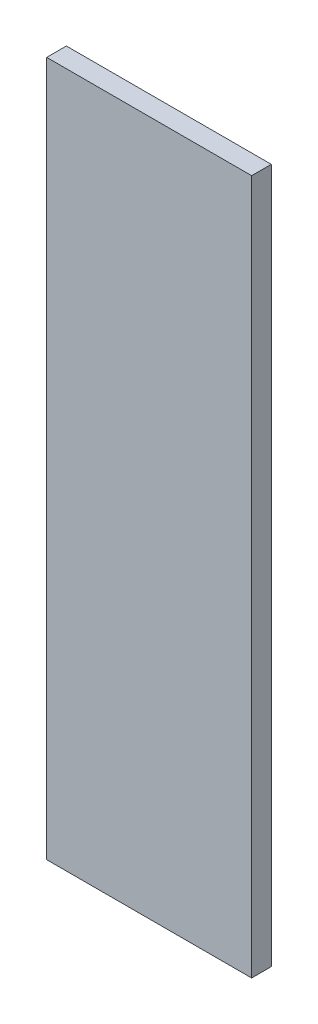
ISO-10303-21;
HEADER;
FILE_DESCRIPTION(('STEP AP214'),'2;1');
FILE_NAME('part.step','',(''),(''),'','','');
FILE_SCHEMA(('AUTOMOTIVE_DESIGN { 1 0 10303 214 1 1 1 1 }'));
ENDSEC;
DATA;
#1=APPLICATION_CONTEXT('core data for automotive mechanical design processes');
#2=APPLICATION_PROTOCOL_DEFINITION('international standard','automotive_design',2000,#1);
#3=PRODUCT_CONTEXT('',#1,'mechanical');
#4=PRODUCT('Part','Part','',(#3));
#5=PRODUCT_RELATED_PRODUCT_CATEGORY('part','',(#4));
#6=PRODUCT_DEFINITION_FORMATION('','',#4);
#7=PRODUCT_DEFINITION_CONTEXT('part definition',#1,'design');
#8=PRODUCT_DEFINITION('design','',#6,#7);
#9=PRODUCT_DEFINITION_SHAPE('','',#8);
#10=(LENGTH_UNIT() NAMED_UNIT(*) SI_UNIT(.MILLI.,.METRE.));
#11=(NAMED_UNIT(*) PLANE_ANGLE_UNIT() SI_UNIT($,.RADIAN.));
#12=(NAMED_UNIT(*) SI_UNIT($,.STERADIAN.) SOLID_ANGLE_UNIT());
#13=UNCERTAINTY_MEASURE_WITH_UNIT(LENGTH_MEASURE(1.E-05),#10,'distance_accuracy_value','');
#14=(GEOMETRIC_REPRESENTATION_CONTEXT(3) GLOBAL_UNCERTAINTY_ASSIGNED_CONTEXT((#13)) GLOBAL_UNIT_ASSIGNED_CONTEXT((#10,
#11,#12)) REPRESENTATION_CONTEXT('',''));
#15=CARTESIAN_POINT('',(0.,0.,0.));
#16=DIRECTION('',(0.,0.,1.));
#17=DIRECTION('',(1.,0.,0.));
#18=AXIS2_PLACEMENT_3D('',#15,#16,#17);
#19=CARTESIAN_POINT('',(0.62500002,2.11916772,0.11999976));
#20=DIRECTION('',(0.,0.,1.));
#21=DIRECTION('',(1.,0.,0.));
#22=AXIS2_PLACEMENT_3D('',#19,#20,#21);
#23=PLANE('',#22);
#24=DIRECTION('',(1.,0.,0.));
#25=VECTOR('',#24,1.);
#26=CARTESIAN_POINT('',(-0.62500002,2.11916772,0.11999976));
#27=LINE('',#26,#25);
#28=CARTESIAN_POINT('',(-0.62500002,2.11916772,0.11999976));
#29=VERTEX_POINT('',#28);
#30=CARTESIAN_POINT('',(0.62500002,2.11916772,0.11999976));
#31=VERTEX_POINT('',#30);
#32=EDGE_CURVE('E27',#29,#31,#27,.T.);
#33=ORIENTED_EDGE('',*,*,#32,.F.);
#34=DIRECTION('',(0.,1.,0.));
#35=VECTOR('',#34,1.);
#36=CARTESIAN_POINT('',(-0.62500002,-2.11916518,0.11999976));
#37=LINE('',#36,#35);
#38=CARTESIAN_POINT('',(-0.62500002,-2.11916518,0.11999976));
#39=VERTEX_POINT('',#38);
#40=EDGE_CURVE('E92',#39,#29,#37,.T.);
#41=ORIENTED_EDGE('',*,*,#40,.F.);
#42=DIRECTION('',(-1.,0.,0.));
#43=VECTOR('',#42,1.);
#44=CARTESIAN_POINT('',(0.62500002,-2.11916518,0.11999976));
#45=LINE('',#44,#43);
#46=CARTESIAN_POINT('',(0.62500002,-2.11916518,0.11999976));
#47=VERTEX_POINT('',#46);
#48=EDGE_CURVE('E20',#47,#39,#45,.T.);
#49=ORIENTED_EDGE('',*,*,#48,.F.);
#50=DIRECTION('',(0.,-1.,0.));
#51=VECTOR('',#50,1.);
#52=CARTESIAN_POINT('',(0.62500002,2.11916772,0.11999976));
#53=LINE('',#52,#51);
#54=EDGE_CURVE('E81',#31,#47,#53,.T.);
#55=ORIENTED_EDGE('',*,*,#54,.F.);
#56=EDGE_LOOP('',(#33,#41,#49,#55));
#57=FACE_BOUND('',#56,.T.);
#58=ADVANCED_FACE('F16',(#57),#23,.T.);
#59=CARTESIAN_POINT('',(0.62500002,2.11916772,0.));
#60=DIRECTION('',(0.,0.,1.));
#61=DIRECTION('',(1.,0.,0.));
#62=AXIS2_PLACEMENT_3D('',#59,#60,#61);
#63=PLANE('',#62);
#64=DIRECTION('',(0.,-1.,0.));
#65=VECTOR('',#64,1.);
#66=CARTESIAN_POINT('',(0.62500002,2.11916772,0.));
#67=LINE('',#66,#65);
#68=CARTESIAN_POINT('',(0.62500002,2.11916772,0.));
#69=VERTEX_POINT('',#68);
#70=CARTESIAN_POINT('',(0.62500002,-2.11916518,0.));
#71=VERTEX_POINT('',#70);
#72=EDGE_CURVE('E66',#69,#71,#67,.T.);
#73=ORIENTED_EDGE('',*,*,#72,.T.);
#74=DIRECTION('',(-1.,0.,0.));
#75=VECTOR('',#74,1.);
#76=CARTESIAN_POINT('',(0.62500002,-2.11916518,0.));
#77=LINE('',#76,#75);
#78=CARTESIAN_POINT('',(-0.62500002,-2.11916518,0.));
#79=VERTEX_POINT('',#78);
#80=EDGE_CURVE('E89',#71,#79,#77,.T.);
#81=ORIENTED_EDGE('',*,*,#80,.T.);
#82=DIRECTION('',(0.,1.,0.));
#83=VECTOR('',#82,1.);
#84=CARTESIAN_POINT('',(-0.62500002,-2.11916518,0.));
#85=LINE('',#84,#83);
#86=CARTESIAN_POINT('',(-0.62500002,2.11916772,0.));
#87=VERTEX_POINT('',#86);
#88=EDGE_CURVE('E68',#79,#87,#85,.T.);
#89=ORIENTED_EDGE('',*,*,#88,.T.);
#90=DIRECTION('',(1.,0.,0.));
#91=VECTOR('',#90,1.);
#92=CARTESIAN_POINT('',(-0.62500002,2.11916772,0.));
#93=LINE('',#92,#91);
#94=EDGE_CURVE('E10',#87,#69,#93,.T.);
#95=ORIENTED_EDGE('',*,*,#94,.T.);
#96=EDGE_LOOP('',(#73,#81,#89,#95));
#97=FACE_BOUND('',#96,.T.);
#98=ADVANCED_FACE('F64',(#97),#63,.F.);
#99=CARTESIAN_POINT('',(-0.62500002,2.11916772,0.));
#100=DIRECTION('',(0.,1.,0.));
#101=DIRECTION('',(1.,0.,0.));
#102=AXIS2_PLACEMENT_3D('',#99,#100,#101);
#103=PLANE('',#102);
#104=DIRECTION('',(0.,0.,1.));
#105=VECTOR('',#104,1.);
#106=CARTESIAN_POINT('',(-0.62500002,2.11916772,0.));
#107=LINE('',#106,#105);
#108=EDGE_CURVE('E98',#87,#29,#107,.T.);
#109=ORIENTED_EDGE('',*,*,#108,.T.);
#110=ORIENTED_EDGE('',*,*,#32,.T.);
#111=DIRECTION('',(0.,0.,1.));
#112=VECTOR('',#111,1.);
#113=CARTESIAN_POINT('',(0.62500002,2.11916772,0.));
#114=LINE('',#113,#112);
#115=EDGE_CURVE('E73',#69,#31,#114,.T.);
#116=ORIENTED_EDGE('',*,*,#115,.F.);
#117=ORIENTED_EDGE('',*,*,#94,.F.);
#118=EDGE_LOOP('',(#109,#110,#116,#117));
#119=FACE_BOUND('',#118,.T.);
#120=ADVANCED_FACE('F78',(#119),#103,.T.);
#121=CARTESIAN_POINT('',(-0.62500002,-2.11916518,0.));
#122=DIRECTION('',(-1.,0.,0.));
#123=DIRECTION('',(0.,0.,1.));
#124=AXIS2_PLACEMENT_3D('',#121,#122,#123);
#125=PLANE('',#124);
#126=DIRECTION('',(0.,0.,1.));
#127=VECTOR('',#126,1.);
#128=CARTESIAN_POINT('',(-0.62500002,-2.11916518,0.));
#129=LINE('',#128,#127);
#130=EDGE_CURVE('E93',#79,#39,#129,.T.);
#131=ORIENTED_EDGE('',*,*,#130,.T.);
#132=ORIENTED_EDGE('',*,*,#40,.T.);
#133=ORIENTED_EDGE('',*,*,#108,.F.);
#134=ORIENTED_EDGE('',*,*,#88,.F.);
#135=EDGE_LOOP('',(#131,#132,#133,#134));
#136=FACE_BOUND('',#135,.T.);
#137=ADVANCED_FACE('F118',(#136),#125,.T.);
#138=CARTESIAN_POINT('',(0.62500002,-2.11916518,0.));
#139=DIRECTION('',(0.,-1.,0.));
#140=DIRECTION('',(0.,0.,-1.));
#141=AXIS2_PLACEMENT_3D('',#138,#139,#140);
#142=PLANE('',#141);
#143=DIRECTION('',(0.,0.,1.));
#144=VECTOR('',#143,1.);
#145=CARTESIAN_POINT('',(0.62500002,-2.11916518,0.));
#146=LINE('',#145,#144);
#147=EDGE_CURVE('E75',#71,#47,#146,.T.);
#148=ORIENTED_EDGE('',*,*,#147,.T.);
#149=ORIENTED_EDGE('',*,*,#48,.T.);
#150=ORIENTED_EDGE('',*,*,#130,.F.);
#151=ORIENTED_EDGE('',*,*,#80,.F.);
#152=EDGE_LOOP('',(#148,#149,#150,#151));
#153=FACE_BOUND('',#152,.T.);
#154=ADVANCED_FACE('F114',(#153),#142,.T.);
#155=CARTESIAN_POINT('',(0.62500002,2.11916772,0.));
#156=DIRECTION('',(1.,0.,0.));
#157=DIRECTION('',(0.,1.,0.));
#158=AXIS2_PLACEMENT_3D('',#155,#156,#157);
#159=PLANE('',#158);
#160=ORIENTED_EDGE('',*,*,#115,.T.);
#161=ORIENTED_EDGE('',*,*,#54,.T.);
#162=ORIENTED_EDGE('',*,*,#147,.F.);
#163=ORIENTED_EDGE('',*,*,#72,.F.);
#164=EDGE_LOOP('',(#160,#161,#162,#163));
#165=FACE_BOUND('',#164,.T.);
#166=ADVANCED_FACE('F18',(#165),#159,.T.);
#167=CLOSED_SHELL('',(#58,#98,#120,#137,#154,#166));
#168=MANIFOLD_SOLID_BREP('B1',#167);
#169=ADVANCED_BREP_SHAPE_REPRESENTATION('',(#18,#168),#14);
#170=SHAPE_DEFINITION_REPRESENTATION(#9,#169);
ENDSEC;
END-ISO-10303-21;
